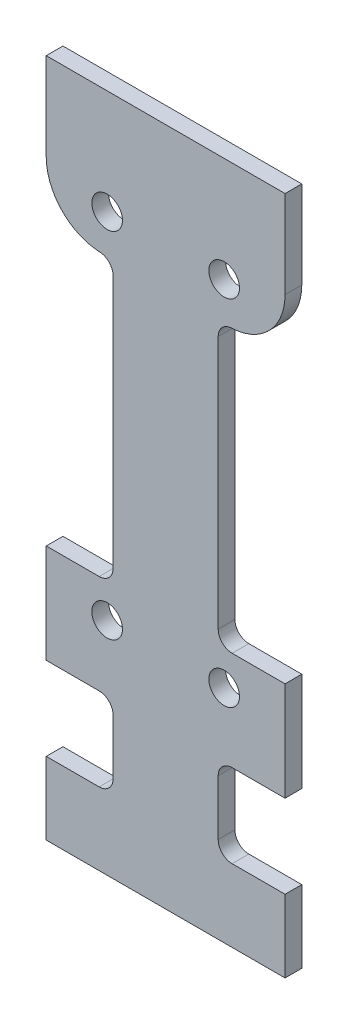
ISO-10303-21;
HEADER;
FILE_DESCRIPTION(('STEP AP214'),'2;1');
FILE_NAME('part.step','',(''),(''),'','','');
FILE_SCHEMA(('AUTOMOTIVE_DESIGN { 1 0 10303 214 1 1 1 1 }'));
ENDSEC;
DATA;
#1=APPLICATION_CONTEXT('core data for automotive mechanical design processes');
#2=APPLICATION_PROTOCOL_DEFINITION('international standard','automotive_design',2000,#1);
#3=PRODUCT_CONTEXT('',#1,'mechanical');
#4=PRODUCT('Part','Part','',(#3));
#5=PRODUCT_RELATED_PRODUCT_CATEGORY('part','',(#4));
#6=PRODUCT_DEFINITION_FORMATION('','',#4);
#7=PRODUCT_DEFINITION_CONTEXT('part definition',#1,'design');
#8=PRODUCT_DEFINITION('design','',#6,#7);
#9=PRODUCT_DEFINITION_SHAPE('','',#8);
#10=(LENGTH_UNIT() NAMED_UNIT(*) SI_UNIT(.MILLI.,.METRE.));
#11=(NAMED_UNIT(*) PLANE_ANGLE_UNIT() SI_UNIT($,.RADIAN.));
#12=(NAMED_UNIT(*) SI_UNIT($,.STERADIAN.) SOLID_ANGLE_UNIT());
#13=UNCERTAINTY_MEASURE_WITH_UNIT(LENGTH_MEASURE(1.E-05),#10,'distance_accuracy_value','');
#14=(GEOMETRIC_REPRESENTATION_CONTEXT(3) GLOBAL_UNCERTAINTY_ASSIGNED_CONTEXT((#13)) GLOBAL_UNIT_ASSIGNED_CONTEXT((#10,
#11,#12)) REPRESENTATION_CONTEXT('',''));
#15=CARTESIAN_POINT('',(0.,0.,0.));
#16=DIRECTION('',(0.,0.,1.));
#17=DIRECTION('',(1.,0.,0.));
#18=AXIS2_PLACEMENT_3D('',#15,#16,#17);
#19=CARTESIAN_POINT('',(0.,0.,-118.08434));
#20=DIRECTION('',(0.,0.,-1.));
#21=DIRECTION('',(-1.,0.,0.));
#22=AXIS2_PLACEMENT_3D('',#19,#20,#21);
#23=PLANE('',#22);
#24=CARTESIAN_POINT('',(21.80508124671,-2.07264,-118.08434));
#25=DIRECTION('',(0.,0.,1.));
#26=DIRECTION('',(1.,0.,0.));
#27=AXIS2_PLACEMENT_3D('',#24,#25,#26);
#28=CIRCLE('',#27,2.75);
#29=CARTESIAN_POINT('',(24.55508124671,-2.07264,-118.08434));
#30=VERTEX_POINT('',#29);
#31=EDGE_CURVE('E363',#30,#30,#28,.F.);
#32=ORIENTED_EDGE('',*,*,#31,.T.);
#33=EDGE_LOOP('',(#32));
#34=FACE_BOUND('',#33,.T.);
#35=CARTESIAN_POINT('',(0.8050812467073,-2.07264,-118.08434));
#36=DIRECTION('',(0.,0.,1.));
#37=DIRECTION('',(1.,0.,0.));
#38=AXIS2_PLACEMENT_3D('',#35,#36,#37);
#39=CIRCLE('',#38,2.75);
#40=CARTESIAN_POINT('',(3.5550812467073,-2.07264,-118.08434));
#41=VERTEX_POINT('',#40);
#42=EDGE_CURVE('E366',#41,#41,#39,.F.);
#43=ORIENTED_EDGE('',*,*,#42,.T.);
#44=EDGE_LOOP('',(#43));
#45=FACE_BOUND('',#44,.T.);
#46=CARTESIAN_POINT('',(21.80508124671,61.42736,-118.08434));
#47=DIRECTION('',(0.,0.,1.));
#48=DIRECTION('',(1.,0.,0.));
#49=AXIS2_PLACEMENT_3D('',#46,#47,#48);
#50=CIRCLE('',#49,2.75);
#51=CARTESIAN_POINT('',(24.55508124671,61.42736,-118.08434));
#52=VERTEX_POINT('',#51);
#53=EDGE_CURVE('E369',#52,#52,#50,.F.);
#54=ORIENTED_EDGE('',*,*,#53,.T.);
#55=EDGE_LOOP('',(#54));
#56=FACE_BOUND('',#55,.T.);
#57=CARTESIAN_POINT('',(0.8050812467073,61.42736,-118.08434));
#58=DIRECTION('',(0.,0.,1.));
#59=DIRECTION('',(1.,0.,0.));
#60=AXIS2_PLACEMENT_3D('',#57,#58,#59);
#61=CIRCLE('',#60,2.75);
#62=CARTESIAN_POINT('',(3.5550812467073,61.42736,-118.08434));
#63=VERTEX_POINT('',#62);
#64=EDGE_CURVE('E214',#63,#63,#61,.F.);
#65=ORIENTED_EDGE('',*,*,#64,.T.);
#66=EDGE_LOOP('',(#65));
#67=FACE_BOUND('',#66,.T.);
#68=DIRECTION('',(0.,1.,0.));
#69=VECTOR('',#68,1.);
#70=CARTESIAN_POINT('',(32.73633124671,80.22336,-118.08434));
#71=LINE('',#70,#69);
#72=CARTESIAN_POINT('',(32.73633124671,64.5048559968,-118.08434));
#73=VERTEX_POINT('',#72);
#74=CARTESIAN_POINT('',(32.73633124671,80.22336,-118.08434));
#75=VERTEX_POINT('',#74);
#76=EDGE_CURVE('E202',#73,#75,#71,.T.);
#77=ORIENTED_EDGE('',*,*,#76,.T.);
#78=DIRECTION('',(1.,0.,0.));
#79=VECTOR('',#78,1.);
#80=CARTESIAN_POINT('',(32.73633124671,80.22336,-118.08434));
#81=LINE('',#80,#79);
#82=CARTESIAN_POINT('',(-10.12616875329,80.22336,-118.08434));
#83=VERTEX_POINT('',#82);
#84=EDGE_CURVE('E220',#75,#83,#81,.F.);
#85=ORIENTED_EDGE('',*,*,#84,.T.);
#86=DIRECTION('',(0.,1.,0.));
#87=VECTOR('',#86,1.);
#88=CARTESIAN_POINT('',(-10.12616875329,80.22336,-118.08434));
#89=LINE('',#88,#87);
#90=CARTESIAN_POINT('',(-10.12616875329,64.5048559968,-118.08434));
#91=VERTEX_POINT('',#90);
#92=EDGE_CURVE('E232',#83,#91,#89,.F.);
#93=ORIENTED_EDGE('',*,*,#92,.T.);
#94=CARTESIAN_POINT('',(-0.1261687532923,64.5048559968,-118.08434));
#95=DIRECTION('',(0.,0.,1.));
#96=DIRECTION('',(1.,0.,0.));
#97=AXIS2_PLACEMENT_3D('',#94,#95,#96);
#98=CIRCLE('',#97,10.);
#99=CARTESIAN_POINT('',(-0.526168753292364,54.512859199361,-118.08434));
#100=VERTEX_POINT('',#99);
#101=EDGE_CURVE('E234',#100,#91,#98,.F.);
#102=ORIENTED_EDGE('',*,*,#101,.F.);
#103=CARTESIAN_POINT('',(-0.6261687532923,52.01486,-118.08434));
#104=DIRECTION('',(0.,0.,1.));
#105=DIRECTION('',(1.,0.,0.));
#106=AXIS2_PLACEMENT_3D('',#103,#104,#105);
#107=CIRCLE('',#106,2.5);
#108=CARTESIAN_POINT('',(1.87383124670785,52.01486,-118.08434));
#109=VERTEX_POINT('',#108);
#110=EDGE_CURVE('E377',#100,#109,#107,.F.);
#111=ORIENTED_EDGE('',*,*,#110,.T.);
#112=DIRECTION('',(0.,1.,0.));
#113=VECTOR('',#112,1.);
#114=CARTESIAN_POINT('',(1.873831246708,0.,-118.08434));
#115=LINE('',#114,#113);
#116=CARTESIAN_POINT('',(1.873831246708,6.52336,-118.08434));
#117=VERTEX_POINT('',#116);
#118=EDGE_CURVE('E237',#109,#117,#115,.F.);
#119=ORIENTED_EDGE('',*,*,#118,.T.);
#120=CARTESIAN_POINT('',(-0.6261687532923,6.52336,-118.08434));
#121=DIRECTION('',(0.,0.,-1.));
#122=DIRECTION('',(-1.,0.,0.));
#123=AXIS2_PLACEMENT_3D('',#120,#121,#122);
#124=CIRCLE('',#123,2.5);
#125=CARTESIAN_POINT('',(-0.6261687532923,4.02336,-118.08434));
#126=VERTEX_POINT('',#125);
#127=EDGE_CURVE('E380',#117,#126,#124,.T.);
#128=ORIENTED_EDGE('',*,*,#127,.T.);
#129=DIRECTION('',(1.,0.,0.));
#130=VECTOR('',#129,1.);
#131=CARTESIAN_POINT('',(1.873831246708,4.02336,-118.08434));
#132=LINE('',#131,#130);
#133=CARTESIAN_POINT('',(-10.12616875329,4.02336,-118.08434));
#134=VERTEX_POINT('',#133);
#135=EDGE_CURVE('E241',#126,#134,#132,.F.);
#136=ORIENTED_EDGE('',*,*,#135,.T.);
#137=DIRECTION('',(0.,1.,0.));
#138=VECTOR('',#137,1.);
#139=CARTESIAN_POINT('',(-10.12616875329,80.22336,-118.08434));
#140=LINE('',#139,#138);
#141=CARTESIAN_POINT('',(-10.12616875329,-13.75664,-118.08434));
#142=VERTEX_POINT('',#141);
#143=EDGE_CURVE('E247',#134,#142,#140,.F.);
#144=ORIENTED_EDGE('',*,*,#143,.T.);
#145=DIRECTION('',(1.,0.,0.));
#146=VECTOR('',#145,1.);
#147=CARTESIAN_POINT('',(1.873831246708,-13.75664,-118.08434));
#148=LINE('',#147,#146);
#149=CARTESIAN_POINT('',(-0.6261687532923,-13.75664,-118.08434));
#150=VERTEX_POINT('',#149);
#151=EDGE_CURVE('E252',#142,#150,#148,.T.);
#152=ORIENTED_EDGE('',*,*,#151,.T.);
#153=CARTESIAN_POINT('',(-0.6261687532923,-16.25664,-118.08434));
#154=DIRECTION('',(0.,0.,-1.));
#155=DIRECTION('',(-1.,0.,0.));
#156=AXIS2_PLACEMENT_3D('',#153,#154,#155);
#157=CIRCLE('',#156,2.5);
#158=CARTESIAN_POINT('',(1.87383124670785,-16.25664,-118.08434));
#159=VERTEX_POINT('',#158);
#160=EDGE_CURVE('E260',#150,#159,#157,.T.);
#161=ORIENTED_EDGE('',*,*,#160,.T.);
#162=DIRECTION('',(0.,1.,0.));
#163=VECTOR('',#162,1.);
#164=CARTESIAN_POINT('',(1.873831246708,0.,-118.08434));
#165=LINE('',#164,#163);
#166=CARTESIAN_POINT('',(1.873831246708,-26.17914,-118.08434));
#167=VERTEX_POINT('',#166);
#168=EDGE_CURVE('E257',#167,#159,#165,.T.);
#169=ORIENTED_EDGE('',*,*,#168,.F.);
#170=CARTESIAN_POINT('',(-0.6261687532923,-26.17914,-118.08434));
#171=DIRECTION('',(0.,0.,1.));
#172=DIRECTION('',(1.,0.,0.));
#173=AXIS2_PLACEMENT_3D('',#170,#171,#172);
#174=CIRCLE('',#173,2.5);
#175=CARTESIAN_POINT('',(-0.6261687532923,-28.67914,-118.08434));
#176=VERTEX_POINT('',#175);
#177=EDGE_CURVE('E383',#167,#176,#174,.F.);
#178=ORIENTED_EDGE('',*,*,#177,.T.);
#179=DIRECTION('',(1.,0.,0.));
#180=VECTOR('',#179,1.);
#181=CARTESIAN_POINT('',(1.873831246708,-28.67914,-118.08434));
#182=LINE('',#181,#180);
#183=CARTESIAN_POINT('',(-10.12616875329,-28.67914,-118.08434));
#184=VERTEX_POINT('',#183);
#185=EDGE_CURVE('E262',#176,#184,#182,.F.);
#186=ORIENTED_EDGE('',*,*,#185,.T.);
#187=DIRECTION('',(0.,1.,0.));
#188=VECTOR('',#187,1.);
#189=CARTESIAN_POINT('',(-10.12616875329,80.22336,-118.08434));
#190=LINE('',#189,#188);
#191=CARTESIAN_POINT('',(-10.12616875329,-41.69664,-118.08434));
#192=VERTEX_POINT('',#191);
#193=EDGE_CURVE('E268',#184,#192,#190,.F.);
#194=ORIENTED_EDGE('',*,*,#193,.T.);
#195=DIRECTION('',(1.,0.,0.));
#196=VECTOR('',#195,1.);
#197=CARTESIAN_POINT('',(0.,-41.69664,-118.08434));
#198=LINE('',#197,#196);
#199=CARTESIAN_POINT('',(32.73633124671,-41.69664,-118.08434));
#200=VERTEX_POINT('',#199);
#201=EDGE_CURVE('E273',#200,#192,#198,.F.);
#202=ORIENTED_EDGE('',*,*,#201,.F.);
#203=DIRECTION('',(0.,1.,0.));
#204=VECTOR('',#203,1.);
#205=CARTESIAN_POINT('',(32.73633124671,80.22336,-118.08434));
#206=LINE('',#205,#204);
#207=CARTESIAN_POINT('',(32.73633124671,-28.67914,-118.08434));
#208=VERTEX_POINT('',#207);
#209=EDGE_CURVE('E276',#200,#208,#206,.T.);
#210=ORIENTED_EDGE('',*,*,#209,.T.);
#211=DIRECTION('',(1.,0.,0.));
#212=VECTOR('',#211,1.);
#213=CARTESIAN_POINT('',(20.73633124671,-28.67914,-118.08434));
#214=LINE('',#213,#212);
#215=CARTESIAN_POINT('',(23.23633124671,-28.67914,-118.08434));
#216=VERTEX_POINT('',#215);
#217=EDGE_CURVE('E284',#216,#208,#214,.T.);
#218=ORIENTED_EDGE('',*,*,#217,.F.);
#219=CARTESIAN_POINT('',(23.23633124671,-26.17914,-118.08434));
#220=DIRECTION('',(0.,0.,-1.));
#221=DIRECTION('',(-1.,0.,0.));
#222=AXIS2_PLACEMENT_3D('',#219,#220,#221);
#223=CIRCLE('',#222,2.5);
#224=CARTESIAN_POINT('',(20.73633124671,-26.17914,-118.08434));
#225=VERTEX_POINT('',#224);
#226=EDGE_CURVE('E292',#216,#225,#223,.T.);
#227=ORIENTED_EDGE('',*,*,#226,.T.);
#228=DIRECTION('',(0.,1.,0.));
#229=VECTOR('',#228,1.);
#230=CARTESIAN_POINT('',(20.73633124671,0.,-118.08434));
#231=LINE('',#230,#229);
#232=CARTESIAN_POINT('',(20.73633124671,-16.25664,-118.08434));
#233=VERTEX_POINT('',#232);
#234=EDGE_CURVE('E289',#233,#225,#231,.F.);
#235=ORIENTED_EDGE('',*,*,#234,.F.);
#236=CARTESIAN_POINT('',(23.23633124671,-16.25664,-118.08434));
#237=DIRECTION('',(0.,0.,1.));
#238=DIRECTION('',(1.,0.,0.));
#239=AXIS2_PLACEMENT_3D('',#236,#237,#238);
#240=CIRCLE('',#239,2.5);
#241=CARTESIAN_POINT('',(23.23633124671,-13.75664,-118.08434));
#242=VERTEX_POINT('',#241);
#243=EDGE_CURVE('E297',#233,#242,#240,.F.);
#244=ORIENTED_EDGE('',*,*,#243,.T.);
#245=DIRECTION('',(1.,0.,0.));
#246=VECTOR('',#245,1.);
#247=CARTESIAN_POINT('',(20.73633124671,-13.75664,-118.08434));
#248=LINE('',#247,#246);
#249=CARTESIAN_POINT('',(32.73633124671,-13.75664,-118.08434));
#250=VERTEX_POINT('',#249);
#251=EDGE_CURVE('E294',#250,#242,#248,.F.);
#252=ORIENTED_EDGE('',*,*,#251,.F.);
#253=DIRECTION('',(0.,1.,0.));
#254=VECTOR('',#253,1.);
#255=CARTESIAN_POINT('',(32.73633124671,80.22336,-118.08434));
#256=LINE('',#255,#254);
#257=CARTESIAN_POINT('',(32.73633124671,4.02336,-118.08434));
#258=VERTEX_POINT('',#257);
#259=EDGE_CURVE('E301',#250,#258,#256,.T.);
#260=ORIENTED_EDGE('',*,*,#259,.T.);
#261=DIRECTION('',(1.,0.,0.));
#262=VECTOR('',#261,1.);
#263=CARTESIAN_POINT('',(20.73633124671,4.02336,-118.08434));
#264=LINE('',#263,#262);
#265=CARTESIAN_POINT('',(23.23633124671,4.02336,-118.08434));
#266=VERTEX_POINT('',#265);
#267=EDGE_CURVE('E307',#266,#258,#264,.T.);
#268=ORIENTED_EDGE('',*,*,#267,.F.);
#269=CARTESIAN_POINT('',(23.23633124671,6.52336,-118.08434));
#270=DIRECTION('',(0.,0.,1.));
#271=DIRECTION('',(1.,0.,0.));
#272=AXIS2_PLACEMENT_3D('',#269,#270,#271);
#273=CIRCLE('',#272,2.5);
#274=CARTESIAN_POINT('',(20.73633124671,6.52336,-118.08434));
#275=VERTEX_POINT('',#274);
#276=EDGE_CURVE('E390',#266,#275,#273,.F.);
#277=ORIENTED_EDGE('',*,*,#276,.T.);
#278=DIRECTION('',(0.,1.,0.));
#279=VECTOR('',#278,1.);
#280=CARTESIAN_POINT('',(20.73633124671,0.,-118.08434));
#281=LINE('',#280,#279);
#282=CARTESIAN_POINT('',(20.73633124671,52.01486,-118.08434));
#283=VERTEX_POINT('',#282);
#284=EDGE_CURVE('E312',#275,#283,#281,.T.);
#285=ORIENTED_EDGE('',*,*,#284,.T.);
#286=CARTESIAN_POINT('',(23.23633124671,52.01486,-118.08434));
#287=DIRECTION('',(0.,0.,-1.));
#288=DIRECTION('',(-1.,0.,0.));
#289=AXIS2_PLACEMENT_3D('',#286,#287,#288);
#290=CIRCLE('',#289,2.5);
#291=CARTESIAN_POINT('',(23.13633124671,54.5128591993594,-118.08434));
#292=VERTEX_POINT('',#291);
#293=EDGE_CURVE('E204',#283,#292,#290,.T.);
#294=ORIENTED_EDGE('',*,*,#293,.T.);
#295=CARTESIAN_POINT('',(22.73633124671,64.5048559968,-118.08434));
#296=DIRECTION('',(0.,0.,-1.));
#297=DIRECTION('',(-1.,0.,0.));
#298=AXIS2_PLACEMENT_3D('',#295,#296,#297);
#299=CIRCLE('',#298,10.);
#300=EDGE_CURVE('E20',#73,#292,#299,.T.);
#301=ORIENTED_EDGE('',*,*,#300,.F.);
#302=EDGE_LOOP('',(#77,#85,#93,#102,#111,#119,#128,#136,#144,#152,#161,#169,#178,#186,#194,#202,
#210,#218,#227,#235,#244,#252,#260,#268,#277,#285,#294,#301));
#303=FACE_BOUND('',#302,.T.);
#304=ADVANCED_FACE('F17',(#34,#45,#56,#67,#303),#23,.F.);
#305=CARTESIAN_POINT('',(22.73633124671,64.5048559968,-121.08434));
#306=DIRECTION('',(0.,0.,-1.));
#307=DIRECTION('',(-1.,0.,0.));
#308=AXIS2_PLACEMENT_3D('',#305,#306,#307);
#309=CYLINDRICAL_SURFACE('',#308,10.);
#310=DIRECTION('',(0.,0.,1.));
#311=VECTOR('',#310,1.);
#312=CARTESIAN_POINT('',(32.73633124671,64.5048559968,-121.08434));
#313=LINE('',#312,#311);
#314=CARTESIAN_POINT('',(32.73633124671,64.5048559968,-121.08434));
#315=VERTEX_POINT('',#314);
#316=EDGE_CURVE('E208',#315,#73,#313,.T.);
#317=ORIENTED_EDGE('',*,*,#316,.T.);
#318=ORIENTED_EDGE('',*,*,#300,.T.);
#319=DIRECTION('',(0.,0.,-1.));
#320=VECTOR('',#319,1.);
#321=CARTESIAN_POINT('',(23.13633124671,54.5128591993594,-121.08434));
#322=LINE('',#321,#320);
#323=CARTESIAN_POINT('',(23.13633124671,54.5128591993594,-121.08434));
#324=VERTEX_POINT('',#323);
#325=EDGE_CURVE('E224',#292,#324,#322,.T.);
#326=ORIENTED_EDGE('',*,*,#325,.T.);
#327=CARTESIAN_POINT('',(22.73633124671,64.5048559968,-121.08434));
#328=DIRECTION('',(0.,0.,-1.));
#329=DIRECTION('',(-1.,0.,0.));
#330=AXIS2_PLACEMENT_3D('',#327,#328,#329);
#331=CIRCLE('',#330,10.);
#332=EDGE_CURVE('E211',#315,#324,#331,.T.);
#333=ORIENTED_EDGE('',*,*,#332,.F.);
#334=EDGE_LOOP('',(#317,#318,#326,#333));
#335=FACE_BOUND('',#334,.T.);
#336=ADVANCED_FACE('F209',(#335),#309,.T.);
#337=CARTESIAN_POINT('',(23.23633124671,52.01486,-121.08434));
#338=DIRECTION('',(0.,0.,-1.));
#339=DIRECTION('',(-1.,0.,0.));
#340=AXIS2_PLACEMENT_3D('',#337,#338,#339);
#341=CYLINDRICAL_SURFACE('',#340,2.5);
#342=ORIENTED_EDGE('',*,*,#293,.F.);
#343=DIRECTION('',(0.,0.,1.));
#344=VECTOR('',#343,1.);
#345=CARTESIAN_POINT('',(20.73633124671,52.01486,0.));
#346=LINE('',#345,#344);
#347=CARTESIAN_POINT('',(20.73633124671,52.01486,-121.08434));
#348=VERTEX_POINT('',#347);
#349=EDGE_CURVE('E313',#283,#348,#346,.F.);
#350=ORIENTED_EDGE('',*,*,#349,.T.);
#351=CARTESIAN_POINT('',(23.23633124671,52.01486,-121.08434));
#352=DIRECTION('',(0.,0.,-1.));
#353=DIRECTION('',(-1.,0.,0.));
#354=AXIS2_PLACEMENT_3D('',#351,#352,#353);
#355=CIRCLE('',#354,2.5);
#356=EDGE_CURVE('E359',#324,#348,#355,.F.);
#357=ORIENTED_EDGE('',*,*,#356,.F.);
#358=ORIENTED_EDGE('',*,*,#325,.F.);
#359=EDGE_LOOP('',(#342,#350,#357,#358));
#360=FACE_BOUND('',#359,.T.);
#361=ADVANCED_FACE('F394',(#360),#341,.F.);
#362=CARTESIAN_POINT('',(20.73633124671,0.,0.));
#363=DIRECTION('',(-1.,0.,0.));
#364=DIRECTION('',(0.,0.,1.));
#365=AXIS2_PLACEMENT_3D('',#362,#363,#364);
#366=PLANE('',#365);
#367=DIRECTION('',(0.,1.,0.));
#368=VECTOR('',#367,1.);
#369=CARTESIAN_POINT('',(20.73633124671,0.,-121.08434));
#370=LINE('',#369,#368);
#371=CARTESIAN_POINT('',(20.73633124671,6.52336,-121.08434));
#372=VERTEX_POINT('',#371);
#373=EDGE_CURVE('E358',#348,#372,#370,.F.);
#374=ORIENTED_EDGE('',*,*,#373,.F.);
#375=ORIENTED_EDGE('',*,*,#349,.F.);
#376=ORIENTED_EDGE('',*,*,#284,.F.);
#377=DIRECTION('',(0.,0.,1.));
#378=VECTOR('',#377,1.);
#379=CARTESIAN_POINT('',(20.73633124671,6.52336,-121.08434));
#380=LINE('',#379,#378);
#381=EDGE_CURVE('E391',#275,#372,#380,.F.);
#382=ORIENTED_EDGE('',*,*,#381,.T.);
#383=EDGE_LOOP('',(#374,#375,#376,#382));
#384=FACE_BOUND('',#383,.T.);
#385=ADVANCED_FACE('F522',(#384),#366,.F.);
#386=CARTESIAN_POINT('',(23.23633124671,6.52336,-121.08434));
#387=DIRECTION('',(0.,0.,1.));
#388=DIRECTION('',(1.,0.,0.));
#389=AXIS2_PLACEMENT_3D('',#386,#387,#388);
#390=CYLINDRICAL_SURFACE('',#389,2.5);
#391=ORIENTED_EDGE('',*,*,#276,.F.);
#392=DIRECTION('',(0.,0.,1.));
#393=VECTOR('',#392,1.);
#394=CARTESIAN_POINT('',(23.23633124671,4.02336,-121.08434));
#395=LINE('',#394,#393);
#396=CARTESIAN_POINT('',(23.23633124671,4.02336,-121.08434));
#397=VERTEX_POINT('',#396);
#398=EDGE_CURVE('E309',#397,#266,#395,.T.);
#399=ORIENTED_EDGE('',*,*,#398,.F.);
#400=CARTESIAN_POINT('',(23.23633124671,6.52336,-121.08434));
#401=DIRECTION('',(0.,0.,1.));
#402=DIRECTION('',(1.,0.,0.));
#403=AXIS2_PLACEMENT_3D('',#400,#401,#402);
#404=CIRCLE('',#403,2.5);
#405=EDGE_CURVE('E354',#372,#397,#404,.T.);
#406=ORIENTED_EDGE('',*,*,#405,.F.);
#407=ORIENTED_EDGE('',*,*,#381,.F.);
#408=EDGE_LOOP('',(#391,#399,#406,#407));
#409=FACE_BOUND('',#408,.T.);
#410=ADVANCED_FACE('F524',(#409),#390,.F.);
#411=CARTESIAN_POINT('',(20.73633124671,4.02336,-121.08434));
#412=DIRECTION('',(0.,1.,0.));
#413=DIRECTION('',(0.,0.,1.));
#414=AXIS2_PLACEMENT_3D('',#411,#412,#413);
#415=PLANE('',#414);
#416=DIRECTION('',(0.,0.,1.));
#417=VECTOR('',#416,1.);
#418=CARTESIAN_POINT('',(32.73633124671,4.02336,-121.08434));
#419=LINE('',#418,#417);
#420=CARTESIAN_POINT('',(32.73633124671,4.02336,-121.08434));
#421=VERTEX_POINT('',#420);
#422=EDGE_CURVE('E304',#258,#421,#419,.F.);
#423=ORIENTED_EDGE('',*,*,#422,.T.);
#424=DIRECTION('',(-1.,0.,0.));
#425=VECTOR('',#424,1.);
#426=CARTESIAN_POINT('',(0.,4.02336,-121.08434));
#427=LINE('',#426,#425);
#428=EDGE_CURVE('E357',#397,#421,#427,.F.);
#429=ORIENTED_EDGE('',*,*,#428,.F.);
#430=ORIENTED_EDGE('',*,*,#398,.T.);
#431=ORIENTED_EDGE('',*,*,#267,.T.);
#432=EDGE_LOOP('',(#423,#429,#430,#431));
#433=FACE_BOUND('',#432,.T.);
#434=ADVANCED_FACE('F528',(#433),#415,.T.);
#435=CARTESIAN_POINT('',(32.73633124671,80.22336,-121.08434));
#436=DIRECTION('',(-1.,0.,0.));
#437=DIRECTION('',(0.,0.,1.));
#438=AXIS2_PLACEMENT_3D('',#435,#436,#437);
#439=PLANE('',#438);
#440=DIRECTION('',(0.,0.,-1.));
#441=VECTOR('',#440,1.);
#442=CARTESIAN_POINT('',(32.73633124671,-13.75664,-116.32184));
#443=LINE('',#442,#441);
#444=CARTESIAN_POINT('',(32.73633124671,-13.75664,-121.08434));
#445=VERTEX_POINT('',#444);
#446=EDGE_CURVE('E298',#445,#250,#443,.F.);
#447=ORIENTED_EDGE('',*,*,#446,.F.);
#448=DIRECTION('',(0.,1.,0.));
#449=VECTOR('',#448,1.);
#450=CARTESIAN_POINT('',(32.73633124671,0.,-121.08434));
#451=LINE('',#450,#449);
#452=EDGE_CURVE('E438',#421,#445,#451,.F.);
#453=ORIENTED_EDGE('',*,*,#452,.F.);
#454=ORIENTED_EDGE('',*,*,#422,.F.);
#455=ORIENTED_EDGE('',*,*,#259,.F.);
#456=EDGE_LOOP('',(#447,#453,#454,#455));
#457=FACE_BOUND('',#456,.T.);
#458=ADVANCED_FACE('F532',(#457),#439,.F.);
#459=CARTESIAN_POINT('',(20.73633124671,-13.75664,-116.32184));
#460=DIRECTION('',(0.,-1.,0.));
#461=DIRECTION('',(0.,0.,-1.));
#462=AXIS2_PLACEMENT_3D('',#459,#460,#461);
#463=PLANE('',#462);
#464=ORIENTED_EDGE('',*,*,#446,.T.);
#465=ORIENTED_EDGE('',*,*,#251,.T.);
#466=DIRECTION('',(0.,0.,1.));
#467=VECTOR('',#466,1.);
#468=CARTESIAN_POINT('',(23.23633124671,-13.75664,-116.32184));
#469=LINE('',#468,#467);
#470=CARTESIAN_POINT('',(23.23633124671,-13.75664,-121.08434));
#471=VERTEX_POINT('',#470);
#472=EDGE_CURVE('E389',#242,#471,#469,.F.);
#473=ORIENTED_EDGE('',*,*,#472,.T.);
#474=DIRECTION('',(-1.,0.,0.));
#475=VECTOR('',#474,1.);
#476=CARTESIAN_POINT('',(0.,-13.75664,-121.08434));
#477=LINE('',#476,#475);
#478=EDGE_CURVE('E353',#445,#471,#477,.T.);
#479=ORIENTED_EDGE('',*,*,#478,.F.);
#480=EDGE_LOOP('',(#464,#465,#473,#479));
#481=FACE_BOUND('',#480,.T.);
#482=ADVANCED_FACE('F536',(#481),#463,.T.);
#483=CARTESIAN_POINT('',(23.23633124671,-16.25664,-116.32184));
#484=DIRECTION('',(0.,0.,1.));
#485=DIRECTION('',(1.,0.,0.));
#486=AXIS2_PLACEMENT_3D('',#483,#484,#485);
#487=CYLINDRICAL_SURFACE('',#486,2.5);
#488=CARTESIAN_POINT('',(23.23633124671,-16.25664,-121.08434));
#489=DIRECTION('',(0.,0.,1.));
#490=DIRECTION('',(1.,0.,0.));
#491=AXIS2_PLACEMENT_3D('',#488,#489,#490);
#492=CIRCLE('',#491,2.5);
#493=CARTESIAN_POINT('',(20.73633124671,-16.25664,-121.08434));
#494=VERTEX_POINT('',#493);
#495=EDGE_CURVE('E350',#471,#494,#492,.T.);
#496=ORIENTED_EDGE('',*,*,#495,.F.);
#497=ORIENTED_EDGE('',*,*,#472,.F.);
#498=ORIENTED_EDGE('',*,*,#243,.F.);
#499=DIRECTION('',(0.,0.,-1.));
#500=VECTOR('',#499,1.);
#501=CARTESIAN_POINT('',(20.73633124671,-16.25664,0.));
#502=LINE('',#501,#500);
#503=EDGE_CURVE('E293',#494,#233,#502,.F.);
#504=ORIENTED_EDGE('',*,*,#503,.F.);
#505=EDGE_LOOP('',(#496,#497,#498,#504));
#506=FACE_BOUND('',#505,.T.);
#507=ADVANCED_FACE('F541',(#506),#487,.F.);
#508=CARTESIAN_POINT('',(20.73633124671,0.,0.));
#509=DIRECTION('',(1.,0.,0.));
#510=DIRECTION('',(0.,0.,-1.));
#511=AXIS2_PLACEMENT_3D('',#508,#509,#510);
#512=PLANE('',#511);
#513=ORIENTED_EDGE('',*,*,#503,.T.);
#514=ORIENTED_EDGE('',*,*,#234,.T.);
#515=DIRECTION('',(0.,0.,-1.));
#516=VECTOR('',#515,1.);
#517=CARTESIAN_POINT('',(20.73633124671,-26.17914,-121.08434));
#518=LINE('',#517,#516);
#519=CARTESIAN_POINT('',(20.73633124671,-26.17914,-121.08434));
#520=VERTEX_POINT('',#519);
#521=EDGE_CURVE('E387',#225,#520,#518,.T.);
#522=ORIENTED_EDGE('',*,*,#521,.T.);
#523=DIRECTION('',(0.,1.,0.));
#524=VECTOR('',#523,1.);
#525=CARTESIAN_POINT('',(20.73633124671,0.,-121.08434));
#526=LINE('',#525,#524);
#527=EDGE_CURVE('E349',#494,#520,#526,.F.);
#528=ORIENTED_EDGE('',*,*,#527,.F.);
#529=EDGE_LOOP('',(#513,#514,#522,#528));
#530=FACE_BOUND('',#529,.T.);
#531=ADVANCED_FACE('F544',(#530),#512,.T.);
#532=CARTESIAN_POINT('',(23.23633124671,-26.17914,-121.08434));
#533=DIRECTION('',(0.,0.,-1.));
#534=DIRECTION('',(-1.,0.,0.));
#535=AXIS2_PLACEMENT_3D('',#532,#533,#534);
#536=CYLINDRICAL_SURFACE('',#535,2.5);
#537=ORIENTED_EDGE('',*,*,#226,.F.);
#538=DIRECTION('',(0.,0.,1.));
#539=VECTOR('',#538,1.);
#540=CARTESIAN_POINT('',(23.23633124671,-28.67914,-121.08434));
#541=LINE('',#540,#539);
#542=CARTESIAN_POINT('',(23.23633124671,-28.67914,-121.08434));
#543=VERTEX_POINT('',#542);
#544=EDGE_CURVE('E286',#543,#216,#541,.T.);
#545=ORIENTED_EDGE('',*,*,#544,.F.);
#546=CARTESIAN_POINT('',(23.23633124671,-26.17914,-121.08434));
#547=DIRECTION('',(0.,0.,-1.));
#548=DIRECTION('',(-1.,0.,0.));
#549=AXIS2_PLACEMENT_3D('',#546,#547,#548);
#550=CIRCLE('',#549,2.5);
#551=EDGE_CURVE('E345',#520,#543,#550,.F.);
#552=ORIENTED_EDGE('',*,*,#551,.F.);
#553=ORIENTED_EDGE('',*,*,#521,.F.);
#554=EDGE_LOOP('',(#537,#545,#552,#553));
#555=FACE_BOUND('',#554,.T.);
#556=ADVANCED_FACE('F548',(#555),#536,.F.);
#557=CARTESIAN_POINT('',(20.73633124671,-28.67914,-121.08434));
#558=DIRECTION('',(0.,1.,0.));
#559=DIRECTION('',(0.,0.,1.));
#560=AXIS2_PLACEMENT_3D('',#557,#558,#559);
#561=PLANE('',#560);
#562=DIRECTION('',(0.,0.,1.));
#563=VECTOR('',#562,1.);
#564=CARTESIAN_POINT('',(32.73633124671,-28.67914,-121.08434));
#565=LINE('',#564,#563);
#566=CARTESIAN_POINT('',(32.73633124671,-28.67914,-121.08434));
#567=VERTEX_POINT('',#566);
#568=EDGE_CURVE('E281',#208,#567,#565,.F.);
#569=ORIENTED_EDGE('',*,*,#568,.T.);
#570=DIRECTION('',(-1.,0.,0.));
#571=VECTOR('',#570,1.);
#572=CARTESIAN_POINT('',(0.,-28.67914,-121.08434));
#573=LINE('',#572,#571);
#574=EDGE_CURVE('E348',#543,#567,#573,.F.);
#575=ORIENTED_EDGE('',*,*,#574,.F.);
#576=ORIENTED_EDGE('',*,*,#544,.T.);
#577=ORIENTED_EDGE('',*,*,#217,.T.);
#578=EDGE_LOOP('',(#569,#575,#576,#577));
#579=FACE_BOUND('',#578,.T.);
#580=ADVANCED_FACE('F552',(#579),#561,.T.);
#581=CARTESIAN_POINT('',(32.73633124671,80.22336,-121.08434));
#582=DIRECTION('',(-1.,0.,0.));
#583=DIRECTION('',(0.,0.,1.));
#584=AXIS2_PLACEMENT_3D('',#581,#582,#583);
#585=PLANE('',#584);
#586=DIRECTION('',(0.,0.,-1.));
#587=VECTOR('',#586,1.);
#588=CARTESIAN_POINT('',(32.73633124671,-41.69664,0.));
#589=LINE('',#588,#587);
#590=CARTESIAN_POINT('',(32.73633124671,-41.69664,-121.08434));
#591=VERTEX_POINT('',#590);
#592=EDGE_CURVE('E270',#591,#200,#589,.F.);
#593=ORIENTED_EDGE('',*,*,#592,.F.);
#594=DIRECTION('',(0.,1.,0.));
#595=VECTOR('',#594,1.);
#596=CARTESIAN_POINT('',(32.73633124671,0.,-121.08434));
#597=LINE('',#596,#595);
#598=EDGE_CURVE('E431',#567,#591,#597,.F.);
#599=ORIENTED_EDGE('',*,*,#598,.F.);
#600=ORIENTED_EDGE('',*,*,#568,.F.);
#601=ORIENTED_EDGE('',*,*,#209,.F.);
#602=EDGE_LOOP('',(#593,#599,#600,#601));
#603=FACE_BOUND('',#602,.T.);
#604=ADVANCED_FACE('F557',(#603),#585,.F.);
#605=CARTESIAN_POINT('',(0.,-41.69664,0.));
#606=DIRECTION('',(0.,-1.,0.));
#607=DIRECTION('',(0.,0.,-1.));
#608=AXIS2_PLACEMENT_3D('',#605,#606,#607);
#609=PLANE('',#608);
#610=DIRECTION('',(-1.,0.,0.));
#611=VECTOR('',#610,1.);
#612=CARTESIAN_POINT('',(0.,-41.69664,-121.08434));
#613=LINE('',#612,#611);
#614=CARTESIAN_POINT('',(-10.12616875329,-41.69664,-121.08434));
#615=VERTEX_POINT('',#614);
#616=EDGE_CURVE('E478',#591,#615,#613,.T.);
#617=ORIENTED_EDGE('',*,*,#616,.F.);
#618=ORIENTED_EDGE('',*,*,#592,.T.);
#619=ORIENTED_EDGE('',*,*,#201,.T.);
#620=DIRECTION('',(0.,0.,-1.));
#621=VECTOR('',#620,1.);
#622=CARTESIAN_POINT('',(-10.12616875329,-41.69664,-121.08434));
#623=LINE('',#622,#621);
#624=EDGE_CURVE('E265',#192,#615,#623,.T.);
#625=ORIENTED_EDGE('',*,*,#624,.T.);
#626=EDGE_LOOP('',(#617,#618,#619,#625));
#627=FACE_BOUND('',#626,.T.);
#628=ADVANCED_FACE('F560',(#627),#609,.T.);
#629=CARTESIAN_POINT('',(-10.12616875329,80.22336,-121.08434));
#630=DIRECTION('',(1.,0.,0.));
#631=DIRECTION('',(0.,0.,-1.));
#632=AXIS2_PLACEMENT_3D('',#629,#630,#631);
#633=PLANE('',#632);
#634=DIRECTION('',(0.,1.,0.));
#635=VECTOR('',#634,1.);
#636=CARTESIAN_POINT('',(-10.12616875329,0.,-121.08434));
#637=LINE('',#636,#635);
#638=CARTESIAN_POINT('',(-10.12616875329,-28.67914,-121.08434));
#639=VERTEX_POINT('',#638);
#640=EDGE_CURVE('E426',#615,#639,#637,.T.);
#641=ORIENTED_EDGE('',*,*,#640,.F.);
#642=ORIENTED_EDGE('',*,*,#624,.F.);
#643=ORIENTED_EDGE('',*,*,#193,.F.);
#644=DIRECTION('',(0.,0.,-1.));
#645=VECTOR('',#644,1.);
#646=CARTESIAN_POINT('',(-10.12616875329,-28.67914,-121.08434));
#647=LINE('',#646,#645);
#648=EDGE_CURVE('E264',#184,#639,#647,.T.);
#649=ORIENTED_EDGE('',*,*,#648,.T.);
#650=EDGE_LOOP('',(#641,#642,#643,#649));
#651=FACE_BOUND('',#650,.T.);
#652=ADVANCED_FACE('F565',(#651),#633,.F.);
#653=CARTESIAN_POINT('',(1.873831246708,-28.67914,-121.08434));
#654=DIRECTION('',(0.,-1.,0.));
#655=DIRECTION('',(0.,0.,-1.));
#656=AXIS2_PLACEMENT_3D('',#653,#654,#655);
#657=PLANE('',#656);
#658=DIRECTION('',(-1.,0.,0.));
#659=VECTOR('',#658,1.);
#660=CARTESIAN_POINT('',(0.,-28.67914,-121.08434));
#661=LINE('',#660,#659);
#662=CARTESIAN_POINT('',(-0.6261687532923,-28.67914,-121.08434));
#663=VERTEX_POINT('',#662);
#664=EDGE_CURVE('E344',#639,#663,#661,.F.);
#665=ORIENTED_EDGE('',*,*,#664,.F.);
#666=ORIENTED_EDGE('',*,*,#648,.F.);
#667=ORIENTED_EDGE('',*,*,#185,.F.);
#668=DIRECTION('',(0.,0.,1.));
#669=VECTOR('',#668,1.);
#670=CARTESIAN_POINT('',(-0.6261687532923,-28.67914,0.));
#671=LINE('',#670,#669);
#672=EDGE_CURVE('E385',#176,#663,#671,.F.);
#673=ORIENTED_EDGE('',*,*,#672,.T.);
#674=EDGE_LOOP('',(#665,#666,#667,#673));
#675=FACE_BOUND('',#674,.T.);
#676=ADVANCED_FACE('F570',(#675),#657,.F.);
#677=CARTESIAN_POINT('',(-0.6261687532923,-26.17914,0.));
#678=DIRECTION('',(0.,0.,1.));
#679=DIRECTION('',(1.,0.,0.));
#680=AXIS2_PLACEMENT_3D('',#677,#678,#679);
#681=CYLINDRICAL_SURFACE('',#680,2.5);
#682=ORIENTED_EDGE('',*,*,#177,.F.);
#683=DIRECTION('',(0.,0.,1.));
#684=VECTOR('',#683,1.);
#685=CARTESIAN_POINT('',(1.873831246708,-26.17914,0.));
#686=LINE('',#685,#684);
#687=CARTESIAN_POINT('',(1.873831246708,-26.17914,-121.08434));
#688=VERTEX_POINT('',#687);
#689=EDGE_CURVE('E261',#688,#167,#686,.T.);
#690=ORIENTED_EDGE('',*,*,#689,.F.);
#691=CARTESIAN_POINT('',(-0.6261687532923,-26.17914,-121.08434));
#692=DIRECTION('',(0.,0.,1.));
#693=DIRECTION('',(1.,0.,0.));
#694=AXIS2_PLACEMENT_3D('',#691,#692,#693);
#695=CIRCLE('',#694,2.5);
#696=EDGE_CURVE('E341',#663,#688,#695,.T.);
#697=ORIENTED_EDGE('',*,*,#696,.F.);
#698=ORIENTED_EDGE('',*,*,#672,.F.);
#699=EDGE_LOOP('',(#682,#690,#697,#698));
#700=FACE_BOUND('',#699,.T.);
#701=ADVANCED_FACE('F574',(#700),#681,.F.);
#702=CARTESIAN_POINT('',(1.873831246708,0.,0.));
#703=DIRECTION('',(-1.,0.,0.));
#704=DIRECTION('',(0.,0.,1.));
#705=AXIS2_PLACEMENT_3D('',#702,#703,#704);
#706=PLANE('',#705);
#707=DIRECTION('',(0.,0.,-1.));
#708=VECTOR('',#707,1.);
#709=CARTESIAN_POINT('',(1.8738312467077,-16.25664,0.));
#710=LINE('',#709,#708);
#711=CARTESIAN_POINT('',(1.87383124670785,-16.25664,-121.08434));
#712=VERTEX_POINT('',#711);
#713=EDGE_CURVE('E254',#159,#712,#710,.T.);
#714=ORIENTED_EDGE('',*,*,#713,.T.);
#715=DIRECTION('',(0.,1.,0.));
#716=VECTOR('',#715,1.);
#717=CARTESIAN_POINT('',(1.873831246708,0.,-121.08434));
#718=LINE('',#717,#716);
#719=EDGE_CURVE('E340',#688,#712,#718,.T.);
#720=ORIENTED_EDGE('',*,*,#719,.F.);
#721=ORIENTED_EDGE('',*,*,#689,.T.);
#722=ORIENTED_EDGE('',*,*,#168,.T.);
#723=EDGE_LOOP('',(#714,#720,#721,#722));
#724=FACE_BOUND('',#723,.T.);
#725=ADVANCED_FACE('F578',(#724),#706,.T.);
#726=CARTESIAN_POINT('',(-0.6261687532923,-16.25664,0.));
#727=DIRECTION('',(0.,0.,-1.));
#728=DIRECTION('',(-1.,0.,0.));
#729=AXIS2_PLACEMENT_3D('',#726,#727,#728);
#730=CYLINDRICAL_SURFACE('',#729,2.5);
#731=CARTESIAN_POINT('',(-0.6261687532923,-16.25664,-121.08434));
#732=DIRECTION('',(0.,0.,-1.));
#733=DIRECTION('',(-1.,0.,0.));
#734=AXIS2_PLACEMENT_3D('',#731,#732,#733);
#735=CIRCLE('',#734,2.5);
#736=CARTESIAN_POINT('',(-0.6261687532923,-13.75664,-121.08434));
#737=VERTEX_POINT('',#736);
#738=EDGE_CURVE('E336',#712,#737,#735,.F.);
#739=ORIENTED_EDGE('',*,*,#738,.F.);
#740=ORIENTED_EDGE('',*,*,#713,.F.);
#741=ORIENTED_EDGE('',*,*,#160,.F.);
#742=DIRECTION('',(0.,0.,1.));
#743=VECTOR('',#742,1.);
#744=CARTESIAN_POINT('',(-0.6261687532923,-13.75664,-116.32184));
#745=LINE('',#744,#743);
#746=EDGE_CURVE('E249',#150,#737,#745,.F.);
#747=ORIENTED_EDGE('',*,*,#746,.T.);
#748=EDGE_LOOP('',(#739,#740,#741,#747));
#749=FACE_BOUND('',#748,.T.);
#750=ADVANCED_FACE('F583',(#749),#730,.F.);
#751=CARTESIAN_POINT('',(1.873831246708,-13.75664,-116.32184));
#752=DIRECTION('',(0.,1.,0.));
#753=DIRECTION('',(0.,0.,1.));
#754=AXIS2_PLACEMENT_3D('',#751,#752,#753);
#755=PLANE('',#754);
#756=ORIENTED_EDGE('',*,*,#151,.F.);
#757=DIRECTION('',(0.,0.,-1.));
#758=VECTOR('',#757,1.);
#759=CARTESIAN_POINT('',(-10.12616875329,-13.75664,-121.08434));
#760=LINE('',#759,#758);
#761=CARTESIAN_POINT('',(-10.12616875329,-13.75664,-121.08434));
#762=VERTEX_POINT('',#761);
#763=EDGE_CURVE('E244',#142,#762,#760,.T.);
#764=ORIENTED_EDGE('',*,*,#763,.T.);
#765=DIRECTION('',(-1.,0.,0.));
#766=VECTOR('',#765,1.);
#767=CARTESIAN_POINT('',(0.,-13.75664,-121.08434));
#768=LINE('',#767,#766);
#769=EDGE_CURVE('E339',#737,#762,#768,.T.);
#770=ORIENTED_EDGE('',*,*,#769,.F.);
#771=ORIENTED_EDGE('',*,*,#746,.F.);
#772=EDGE_LOOP('',(#756,#764,#770,#771));
#773=FACE_BOUND('',#772,.T.);
#774=ADVANCED_FACE('F588',(#773),#755,.F.);
#775=CARTESIAN_POINT('',(-10.12616875329,80.22336,-121.08434));
#776=DIRECTION('',(1.,0.,0.));
#777=DIRECTION('',(0.,0.,-1.));
#778=AXIS2_PLACEMENT_3D('',#775,#776,#777);
#779=PLANE('',#778);
#780=DIRECTION('',(0.,1.,0.));
#781=VECTOR('',#780,1.);
#782=CARTESIAN_POINT('',(-10.12616875329,0.,-121.08434));
#783=LINE('',#782,#781);
#784=CARTESIAN_POINT('',(-10.12616875329,4.02336,-121.08434));
#785=VERTEX_POINT('',#784);
#786=EDGE_CURVE('E415',#762,#785,#783,.T.);
#787=ORIENTED_EDGE('',*,*,#786,.F.);
#788=ORIENTED_EDGE('',*,*,#763,.F.);
#789=ORIENTED_EDGE('',*,*,#143,.F.);
#790=DIRECTION('',(0.,0.,-1.));
#791=VECTOR('',#790,1.);
#792=CARTESIAN_POINT('',(-10.12616875329,4.02336,-121.08434));
#793=LINE('',#792,#791);
#794=EDGE_CURVE('E243',#134,#785,#793,.T.);
#795=ORIENTED_EDGE('',*,*,#794,.T.);
#796=EDGE_LOOP('',(#787,#788,#789,#795));
#797=FACE_BOUND('',#796,.T.);
#798=ADVANCED_FACE('F593',(#797),#779,.F.);
#799=CARTESIAN_POINT('',(1.873831246708,4.02336,-121.08434));
#800=DIRECTION('',(0.,-1.,0.));
#801=DIRECTION('',(0.,0.,-1.));
#802=AXIS2_PLACEMENT_3D('',#799,#800,#801);
#803=PLANE('',#802);
#804=DIRECTION('',(-1.,0.,0.));
#805=VECTOR('',#804,1.);
#806=CARTESIAN_POINT('',(0.,4.02336,-121.08434));
#807=LINE('',#806,#805);
#808=CARTESIAN_POINT('',(-0.6261687532923,4.02336,-121.08434));
#809=VERTEX_POINT('',#808);
#810=EDGE_CURVE('E335',#785,#809,#807,.F.);
#811=ORIENTED_EDGE('',*,*,#810,.F.);
#812=ORIENTED_EDGE('',*,*,#794,.F.);
#813=ORIENTED_EDGE('',*,*,#135,.F.);
#814=DIRECTION('',(0.,0.,-1.));
#815=VECTOR('',#814,1.);
#816=CARTESIAN_POINT('',(-0.6261687532923,4.02336,0.));
#817=LINE('',#816,#815);
#818=EDGE_CURVE('E240',#126,#809,#817,.T.);
#819=ORIENTED_EDGE('',*,*,#818,.T.);
#820=EDGE_LOOP('',(#811,#812,#813,#819));
#821=FACE_BOUND('',#820,.T.);
#822=ADVANCED_FACE('F598',(#821),#803,.F.);
#823=CARTESIAN_POINT('',(-0.6261687532923,6.52336,0.));
#824=DIRECTION('',(0.,0.,-1.));
#825=DIRECTION('',(-1.,0.,0.));
#826=AXIS2_PLACEMENT_3D('',#823,#824,#825);
#827=CYLINDRICAL_SURFACE('',#826,2.5);
#828=ORIENTED_EDGE('',*,*,#127,.F.);
#829=DIRECTION('',(0.,0.,-1.));
#830=VECTOR('',#829,1.);
#831=CARTESIAN_POINT('',(1.873831246708,6.52336,0.));
#832=LINE('',#831,#830);
#833=CARTESIAN_POINT('',(1.873831246708,6.52336,-121.08434));
#834=VERTEX_POINT('',#833);
#835=EDGE_CURVE('E239',#117,#834,#832,.T.);
#836=ORIENTED_EDGE('',*,*,#835,.T.);
#837=CARTESIAN_POINT('',(-0.6261687532923,6.52336,-121.08434));
#838=DIRECTION('',(0.,0.,-1.));
#839=DIRECTION('',(-1.,0.,0.));
#840=AXIS2_PLACEMENT_3D('',#837,#838,#839);
#841=CIRCLE('',#840,2.5);
#842=EDGE_CURVE('E332',#809,#834,#841,.F.);
#843=ORIENTED_EDGE('',*,*,#842,.F.);
#844=ORIENTED_EDGE('',*,*,#818,.F.);
#845=EDGE_LOOP('',(#828,#836,#843,#844));
#846=FACE_BOUND('',#845,.T.);
#847=ADVANCED_FACE('F603',(#846),#827,.F.);
#848=CARTESIAN_POINT('',(1.873831246708,0.,0.));
#849=DIRECTION('',(1.,0.,0.));
#850=DIRECTION('',(0.,0.,-1.));
#851=AXIS2_PLACEMENT_3D('',#848,#849,#850);
#852=PLANE('',#851);
#853=ORIENTED_EDGE('',*,*,#118,.F.);
#854=DIRECTION('',(0.,0.,1.));
#855=VECTOR('',#854,1.);
#856=CARTESIAN_POINT('',(1.8738312467077,52.01486,0.));
#857=LINE('',#856,#855);
#858=CARTESIAN_POINT('',(1.87383124670785,52.01486,-121.08434));
#859=VERTEX_POINT('',#858);
#860=EDGE_CURVE('E379',#109,#859,#857,.F.);
#861=ORIENTED_EDGE('',*,*,#860,.T.);
#862=DIRECTION('',(0.,1.,0.));
#863=VECTOR('',#862,1.);
#864=CARTESIAN_POINT('',(1.873831246708,0.,-121.08434));
#865=LINE('',#864,#863);
#866=EDGE_CURVE('E331',#834,#859,#865,.T.);
#867=ORIENTED_EDGE('',*,*,#866,.F.);
#868=ORIENTED_EDGE('',*,*,#835,.F.);
#869=EDGE_LOOP('',(#853,#861,#867,#868));
#870=FACE_BOUND('',#869,.T.);
#871=ADVANCED_FACE('F609',(#870),#852,.F.);
#872=CARTESIAN_POINT('',(-0.6261687532923,52.01486,0.));
#873=DIRECTION('',(0.,0.,1.));
#874=DIRECTION('',(1.,0.,0.));
#875=AXIS2_PLACEMENT_3D('',#872,#873,#874);
#876=CYLINDRICAL_SURFACE('',#875,2.5);
#877=CARTESIAN_POINT('',(-0.6261687532923,52.01486,-121.08434));
#878=DIRECTION('',(0.,0.,1.));
#879=DIRECTION('',(1.,0.,0.));
#880=AXIS2_PLACEMENT_3D('',#877,#878,#879);
#881=CIRCLE('',#880,2.5);
#882=CARTESIAN_POINT('',(-0.5261687532923,54.5128591993626,-121.08434));
#883=VERTEX_POINT('',#882);
#884=EDGE_CURVE('E328',#859,#883,#881,.T.);
#885=ORIENTED_EDGE('',*,*,#884,.F.);
#886=ORIENTED_EDGE('',*,*,#860,.F.);
#887=ORIENTED_EDGE('',*,*,#110,.F.);
#888=DIRECTION('',(0.,0.,1.));
#889=VECTOR('',#888,1.);
#890=CARTESIAN_POINT('',(-0.526168753292402,54.5128591993626,0.));
#891=LINE('',#890,#889);
#892=EDGE_CURVE('E376',#883,#100,#891,.T.);
#893=ORIENTED_EDGE('',*,*,#892,.F.);
#894=EDGE_LOOP('',(#885,#886,#887,#893));
#895=FACE_BOUND('',#894,.T.);
#896=ADVANCED_FACE('F612',(#895),#876,.F.);
#897=CARTESIAN_POINT('',(-0.1261687532923,64.5048559968,0.));
#898=DIRECTION('',(0.,0.,1.));
#899=DIRECTION('',(1.,0.,0.));
#900=AXIS2_PLACEMENT_3D('',#897,#898,#899);
#901=CYLINDRICAL_SURFACE('',#900,10.);
#902=ORIENTED_EDGE('',*,*,#892,.T.);
#903=ORIENTED_EDGE('',*,*,#101,.T.);
#904=DIRECTION('',(0.,0.,-1.));
#905=VECTOR('',#904,1.);
#906=CARTESIAN_POINT('',(-10.12616875329,64.5048559968,-121.08434));
#907=LINE('',#906,#905);
#908=CARTESIAN_POINT('',(-10.12616875329,64.5048559968,-121.08434));
#909=VERTEX_POINT('',#908);
#910=EDGE_CURVE('E229',#91,#909,#907,.T.);
#911=ORIENTED_EDGE('',*,*,#910,.T.);
#912=CARTESIAN_POINT('',(-0.1261687532923,64.5048559968,-121.08434));
#913=DIRECTION('',(0.,0.,1.));
#914=DIRECTION('',(1.,0.,0.));
#915=AXIS2_PLACEMENT_3D('',#912,#913,#914);
#916=CIRCLE('',#915,10.);
#917=EDGE_CURVE('E324',#883,#909,#916,.F.);
#918=ORIENTED_EDGE('',*,*,#917,.F.);
#919=EDGE_LOOP('',(#902,#903,#911,#918));
#920=FACE_BOUND('',#919,.T.);
#921=ADVANCED_FACE('F616',(#920),#901,.T.);
#922=CARTESIAN_POINT('',(-10.12616875329,80.22336,-121.08434));
#923=DIRECTION('',(1.,0.,0.));
#924=DIRECTION('',(0.,0.,-1.));
#925=AXIS2_PLACEMENT_3D('',#922,#923,#924);
#926=PLANE('',#925);
#927=ORIENTED_EDGE('',*,*,#92,.F.);
#928=DIRECTION('',(0.,0.,-1.));
#929=VECTOR('',#928,1.);
#930=CARTESIAN_POINT('',(-10.12616875329,80.22336,-121.08434));
#931=LINE('',#930,#929);
#932=CARTESIAN_POINT('',(-10.12616875329,80.22336,-121.08434));
#933=VERTEX_POINT('',#932);
#934=EDGE_CURVE('E217',#83,#933,#931,.T.);
#935=ORIENTED_EDGE('',*,*,#934,.T.);
#936=DIRECTION('',(0.,1.,0.));
#937=VECTOR('',#936,1.);
#938=CARTESIAN_POINT('',(-10.12616875329,0.,-121.08434));
#939=LINE('',#938,#937);
#940=EDGE_CURVE('E327',#909,#933,#939,.T.);
#941=ORIENTED_EDGE('',*,*,#940,.F.);
#942=ORIENTED_EDGE('',*,*,#910,.F.);
#943=EDGE_LOOP('',(#927,#935,#941,#942));
#944=FACE_BOUND('',#943,.T.);
#945=ADVANCED_FACE('F621',(#944),#926,.F.);
#946=CARTESIAN_POINT('',(32.73633124671,80.22336,-121.08434));
#947=DIRECTION('',(0.,-1.,0.));
#948=DIRECTION('',(0.,0.,-1.));
#949=AXIS2_PLACEMENT_3D('',#946,#947,#948);
#950=PLANE('',#949);
#951=DIRECTION('',(-1.,0.,0.));
#952=VECTOR('',#951,1.);
#953=CARTESIAN_POINT('',(0.,80.22336,-121.08434));
#954=LINE('',#953,#952);
#955=CARTESIAN_POINT('',(32.73633124671,80.22336,-121.08434));
#956=VERTEX_POINT('',#955);
#957=EDGE_CURVE('E402',#933,#956,#954,.F.);
#958=ORIENTED_EDGE('',*,*,#957,.F.);
#959=ORIENTED_EDGE('',*,*,#934,.F.);
#960=ORIENTED_EDGE('',*,*,#84,.F.);
#961=DIRECTION('',(0.,0.,1.));
#962=VECTOR('',#961,1.);
#963=CARTESIAN_POINT('',(32.73633124671,80.22336,-121.08434));
#964=LINE('',#963,#962);
#965=EDGE_CURVE('E35',#75,#956,#964,.F.);
#966=ORIENTED_EDGE('',*,*,#965,.T.);
#967=EDGE_LOOP('',(#958,#959,#960,#966));
#968=FACE_BOUND('',#967,.T.);
#969=ADVANCED_FACE('F623',(#968),#950,.F.);
#970=CARTESIAN_POINT('',(32.73633124671,80.22336,-121.08434));
#971=DIRECTION('',(-1.,0.,0.));
#972=DIRECTION('',(0.,0.,1.));
#973=AXIS2_PLACEMENT_3D('',#970,#971,#972);
#974=PLANE('',#973);
#975=DIRECTION('',(0.,1.,0.));
#976=VECTOR('',#975,1.);
#977=CARTESIAN_POINT('',(32.73633124671,0.,-121.08434));
#978=LINE('',#977,#976);
#979=EDGE_CURVE('E323',#956,#315,#978,.F.);
#980=ORIENTED_EDGE('',*,*,#979,.F.);
#981=ORIENTED_EDGE('',*,*,#965,.F.);
#982=ORIENTED_EDGE('',*,*,#76,.F.);
#983=ORIENTED_EDGE('',*,*,#316,.F.);
#984=EDGE_LOOP('',(#980,#981,#982,#983));
#985=FACE_BOUND('',#984,.T.);
#986=ADVANCED_FACE('F216',(#985),#974,.F.);
#987=CARTESIAN_POINT('',(0.8050812467073,61.42736,-118.08434));
#988=DIRECTION('',(0.,0.,1.));
#989=DIRECTION('',(1.,0.,0.));
#990=AXIS2_PLACEMENT_3D('',#987,#988,#989);
#991=CYLINDRICAL_SURFACE('',#990,2.75);
#992=ORIENTED_EDGE('',*,*,#64,.F.);
#993=EDGE_LOOP('',(#992));
#994=FACE_BOUND('',#993,.T.);
#995=CARTESIAN_POINT('',(0.8050812467073,61.42736,-121.08434));
#996=DIRECTION('',(0.,0.,1.));
#997=DIRECTION('',(1.,0.,0.));
#998=AXIS2_PLACEMENT_3D('',#995,#996,#997);
#999=CIRCLE('',#998,2.75);
#1000=CARTESIAN_POINT('',(3.5550812467073,61.42736,-121.08434));
#1001=VERTEX_POINT('',#1000);
#1002=EDGE_CURVE('E320',#1001,#1001,#999,.T.);
#1003=ORIENTED_EDGE('',*,*,#1002,.F.);
#1004=EDGE_LOOP('',(#1003));
#1005=FACE_BOUND('',#1004,.T.);
#1006=ADVANCED_FACE('F631',(#994,#1005),#991,.F.);
#1007=CARTESIAN_POINT('',(21.80508124671,61.42736,-118.08434));
#1008=DIRECTION('',(0.,0.,1.));
#1009=DIRECTION('',(1.,0.,0.));
#1010=AXIS2_PLACEMENT_3D('',#1007,#1008,#1009);
#1011=CYLINDRICAL_SURFACE('',#1010,2.75);
#1012=ORIENTED_EDGE('',*,*,#53,.F.);
#1013=EDGE_LOOP('',(#1012));
#1014=FACE_BOUND('',#1013,.T.);
#1015=CARTESIAN_POINT('',(21.80508124671,61.42736,-121.08434));
#1016=DIRECTION('',(0.,0.,1.));
#1017=DIRECTION('',(1.,0.,0.));
#1018=AXIS2_PLACEMENT_3D('',#1015,#1016,#1017);
#1019=CIRCLE('',#1018,2.75);
#1020=CARTESIAN_POINT('',(24.55508124671,61.42736,-121.08434));
#1021=VERTEX_POINT('',#1020);
#1022=EDGE_CURVE('E317',#1021,#1021,#1019,.T.);
#1023=ORIENTED_EDGE('',*,*,#1022,.F.);
#1024=EDGE_LOOP('',(#1023));
#1025=FACE_BOUND('',#1024,.T.);
#1026=ADVANCED_FACE('F648',(#1014,#1025),#1011,.F.);
#1027=CARTESIAN_POINT('',(0.8050812467073,-2.07264,-118.08434));
#1028=DIRECTION('',(0.,0.,1.));
#1029=DIRECTION('',(1.,0.,0.));
#1030=AXIS2_PLACEMENT_3D('',#1027,#1028,#1029);
#1031=CYLINDRICAL_SURFACE('',#1030,2.75);
#1032=ORIENTED_EDGE('',*,*,#42,.F.);
#1033=EDGE_LOOP('',(#1032));
#1034=FACE_BOUND('',#1033,.T.);
#1035=CARTESIAN_POINT('',(0.8050812467073,-2.07264,-121.08434));
#1036=DIRECTION('',(0.,0.,1.));
#1037=DIRECTION('',(1.,0.,0.));
#1038=AXIS2_PLACEMENT_3D('',#1035,#1036,#1037);
#1039=CIRCLE('',#1038,2.75);
#1040=CARTESIAN_POINT('',(3.5550812467073,-2.07264,-121.08434));
#1041=VERTEX_POINT('',#1040);
#1042=EDGE_CURVE('E26',#1041,#1041,#1039,.T.);
#1043=ORIENTED_EDGE('',*,*,#1042,.F.);
#1044=EDGE_LOOP('',(#1043));
#1045=FACE_BOUND('',#1044,.T.);
#1046=ADVANCED_FACE('F641',(#1034,#1045),#1031,.F.);
#1047=CARTESIAN_POINT('',(21.80508124671,-2.07264,-118.08434));
#1048=DIRECTION('',(0.,0.,1.));
#1049=DIRECTION('',(1.,0.,0.));
#1050=AXIS2_PLACEMENT_3D('',#1047,#1048,#1049);
#1051=CYLINDRICAL_SURFACE('',#1050,2.75);
#1052=ORIENTED_EDGE('',*,*,#31,.F.);
#1053=EDGE_LOOP('',(#1052));
#1054=FACE_BOUND('',#1053,.T.);
#1055=CARTESIAN_POINT('',(21.80508124671,-2.07264,-121.08434));
#1056=DIRECTION('',(0.,0.,1.));
#1057=DIRECTION('',(1.,0.,0.));
#1058=AXIS2_PLACEMENT_3D('',#1055,#1056,#1057);
#1059=CIRCLE('',#1058,2.75);
#1060=CARTESIAN_POINT('',(24.55508124671,-2.07264,-121.08434));
#1061=VERTEX_POINT('',#1060);
#1062=EDGE_CURVE('E11',#1061,#1061,#1059,.T.);
#1063=ORIENTED_EDGE('',*,*,#1062,.F.);
#1064=EDGE_LOOP('',(#1063));
#1065=FACE_BOUND('',#1064,.T.);
#1066=ADVANCED_FACE('F635',(#1054,#1065),#1051,.F.);
#1067=CARTESIAN_POINT('',(0.,0.,-121.08434));
#1068=DIRECTION('',(0.,0.,-1.));
#1069=DIRECTION('',(-1.,0.,0.));
#1070=AXIS2_PLACEMENT_3D('',#1067,#1068,#1069);
#1071=PLANE('',#1070);
#1072=ORIENTED_EDGE('',*,*,#1062,.T.);
#1073=EDGE_LOOP('',(#1072));
#1074=FACE_BOUND('',#1073,.T.);
#1075=ORIENTED_EDGE('',*,*,#1042,.T.);
#1076=EDGE_LOOP('',(#1075));
#1077=FACE_BOUND('',#1076,.T.);
#1078=ORIENTED_EDGE('',*,*,#1022,.T.);
#1079=EDGE_LOOP('',(#1078));
#1080=FACE_BOUND('',#1079,.T.);
#1081=ORIENTED_EDGE('',*,*,#1002,.T.);
#1082=EDGE_LOOP('',(#1081));
#1083=FACE_BOUND('',#1082,.T.);
#1084=ORIENTED_EDGE('',*,*,#957,.T.);
#1085=ORIENTED_EDGE('',*,*,#979,.T.);
#1086=ORIENTED_EDGE('',*,*,#332,.T.);
#1087=ORIENTED_EDGE('',*,*,#356,.T.);
#1088=ORIENTED_EDGE('',*,*,#373,.T.);
#1089=ORIENTED_EDGE('',*,*,#405,.T.);
#1090=ORIENTED_EDGE('',*,*,#428,.T.);
#1091=ORIENTED_EDGE('',*,*,#452,.T.);
#1092=ORIENTED_EDGE('',*,*,#478,.T.);
#1093=ORIENTED_EDGE('',*,*,#495,.T.);
#1094=ORIENTED_EDGE('',*,*,#527,.T.);
#1095=ORIENTED_EDGE('',*,*,#551,.T.);
#1096=ORIENTED_EDGE('',*,*,#574,.T.);
#1097=ORIENTED_EDGE('',*,*,#598,.T.);
#1098=ORIENTED_EDGE('',*,*,#616,.T.);
#1099=ORIENTED_EDGE('',*,*,#640,.T.);
#1100=ORIENTED_EDGE('',*,*,#664,.T.);
#1101=ORIENTED_EDGE('',*,*,#696,.T.);
#1102=ORIENTED_EDGE('',*,*,#719,.T.);
#1103=ORIENTED_EDGE('',*,*,#738,.T.);
#1104=ORIENTED_EDGE('',*,*,#769,.T.);
#1105=ORIENTED_EDGE('',*,*,#786,.T.);
#1106=ORIENTED_EDGE('',*,*,#810,.T.);
#1107=ORIENTED_EDGE('',*,*,#842,.T.);
#1108=ORIENTED_EDGE('',*,*,#866,.T.);
#1109=ORIENTED_EDGE('',*,*,#884,.T.);
#1110=ORIENTED_EDGE('',*,*,#917,.T.);
#1111=ORIENTED_EDGE('',*,*,#940,.T.);
#1112=EDGE_LOOP('',(#1084,#1085,#1086,#1087,#1088,#1089,#1090,#1091,#1092,#1093,#1094,#1095,
#1096,#1097,#1098,#1099,#1100,#1101,#1102,#1103,#1104,#1105,#1106,#1107,#1108,#1109,#1110,#1111));
#1113=FACE_BOUND('',#1112,.T.);
#1114=ADVANCED_FACE('F400',(#1074,#1077,#1080,#1083,#1113),#1071,.T.);
#1115=CLOSED_SHELL('',(#304,#336,#361,#385,#410,#434,#458,#482,#507,#531,#556,#580,#604,#628,
#652,#676,#701,#725,#750,#774,#798,#822,#847,#871,#896,#921,#945,#969,#986,#1006,#1026,#1046,
#1066,#1114));
#1116=MANIFOLD_SOLID_BREP('B1',#1115);
#1117=ADVANCED_BREP_SHAPE_REPRESENTATION('',(#18,#1116),#14);
#1118=SHAPE_DEFINITION_REPRESENTATION(#9,#1117);
ENDSEC;
END-ISO-10303-21;
